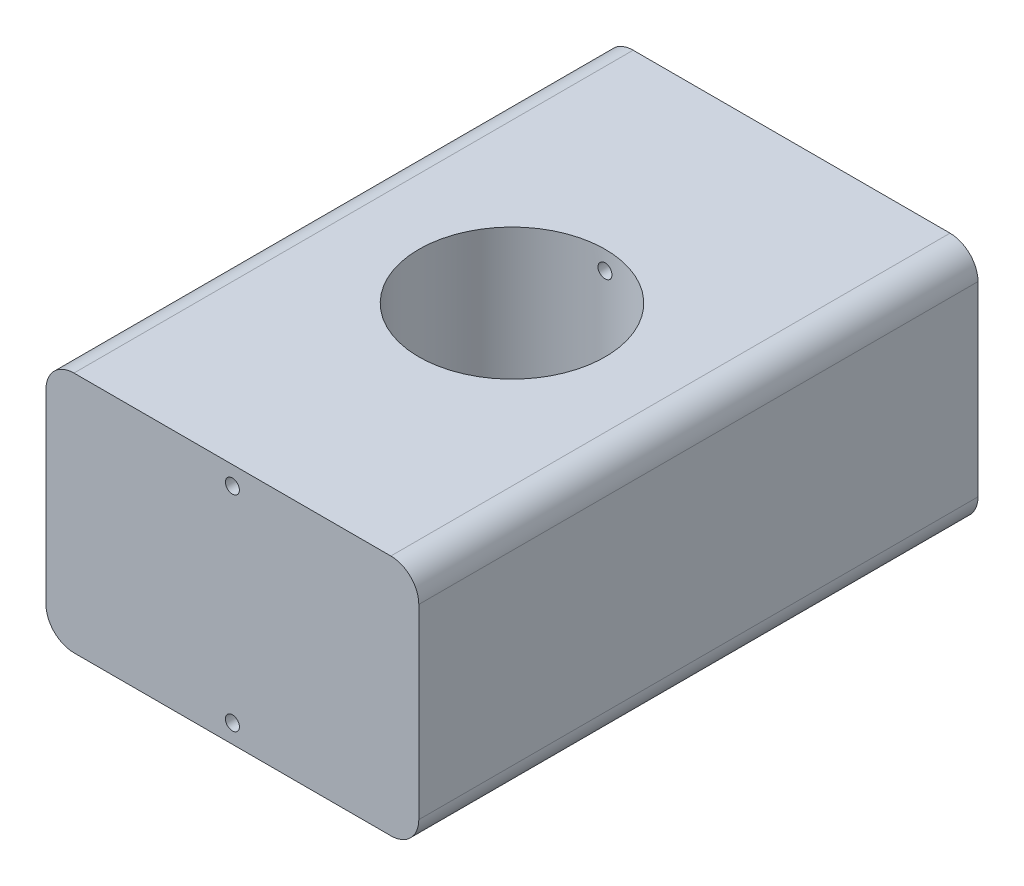
ISO-10303-21;
HEADER;
FILE_DESCRIPTION(('STEP AP214'),'2;1');
FILE_NAME('part.step','',(''),(''),'','','');
FILE_SCHEMA(('AUTOMOTIVE_DESIGN { 1 0 10303 214 1 1 1 1 }'));
ENDSEC;
DATA;
#1=APPLICATION_CONTEXT('core data for automotive mechanical design processes');
#2=APPLICATION_PROTOCOL_DEFINITION('international standard','automotive_design',2000,#1);
#3=PRODUCT_CONTEXT('',#1,'mechanical');
#4=PRODUCT('Part','Part','',(#3));
#5=PRODUCT_RELATED_PRODUCT_CATEGORY('part','',(#4));
#6=PRODUCT_DEFINITION_FORMATION('','',#4);
#7=PRODUCT_DEFINITION_CONTEXT('part definition',#1,'design');
#8=PRODUCT_DEFINITION('design','',#6,#7);
#9=PRODUCT_DEFINITION_SHAPE('','',#8);
#10=(LENGTH_UNIT() NAMED_UNIT(*) SI_UNIT(.MILLI.,.METRE.));
#11=(NAMED_UNIT(*) PLANE_ANGLE_UNIT() SI_UNIT($,.RADIAN.));
#12=(NAMED_UNIT(*) SI_UNIT($,.STERADIAN.) SOLID_ANGLE_UNIT());
#13=UNCERTAINTY_MEASURE_WITH_UNIT(LENGTH_MEASURE(1.E-05),#10,'distance_accuracy_value','');
#14=(GEOMETRIC_REPRESENTATION_CONTEXT(3) GLOBAL_UNCERTAINTY_ASSIGNED_CONTEXT((#13)) GLOBAL_UNIT_ASSIGNED_CONTEXT((#10,
#11,#12)) REPRESENTATION_CONTEXT('',''));
#15=CARTESIAN_POINT('',(0.,0.,0.));
#16=DIRECTION('',(0.,0.,1.));
#17=DIRECTION('',(1.,0.,0.));
#18=AXIS2_PLACEMENT_3D('',#15,#16,#17);
#19=CARTESIAN_POINT('',(0.,11.,60.));
#20=DIRECTION('',(0.,0.,-1.));
#21=DIRECTION('',(-1.,0.,0.));
#22=AXIS2_PLACEMENT_3D('',#19,#20,#21);
#23=CYLINDRICAL_SURFACE('',#22,0.75);
#24=CARTESIAN_POINT('',(-0.749999999999998,11.,39.9718353375896));
#25=CARTESIAN_POINT('',(-0.749998156422003,10.957935782861,39.9718357123555));
#26=CARTESIAN_POINT('',(-0.746449303697193,10.9158425741027,39.9721043609987));
#27=CARTESIAN_POINT('',(-0.732343920689902,10.8328197921761,39.9731499771179));
#28=CARTESIAN_POINT('',(-0.721779356159142,10.791891609276,39.9739275273627));
#29=CARTESIAN_POINT('',(-0.693948896624594,10.7124134082848,39.9759023845808));
#30=CARTESIAN_POINT('',(-0.676686687047649,10.6738620958004,39.9770994606721));
#31=CARTESIAN_POINT('',(-0.635957254899256,10.6002137472712,39.9797781979895));
#32=CARTESIAN_POINT('',(-0.612491399750993,10.5651159523299,39.9812597964808));
#33=CARTESIAN_POINT('',(-0.559967163907113,10.4992874881081,39.9843441490868));
#34=CARTESIAN_POINT('',(-0.530898444002643,10.4685650780521,39.9859471238096));
#35=CARTESIAN_POINT('',(-0.468015336253382,10.4124303376761,39.9890915810603));
#36=CARTESIAN_POINT('',(-0.434200745296518,10.3870182347407,39.9906330609528));
#37=CARTESIAN_POINT('',(-0.362737435634397,10.3421987239576,39.9934828697797));
#38=CARTESIAN_POINT('',(-0.325084292730746,10.3227983514527,39.9947909247909));
#39=CARTESIAN_POINT('',(-0.247043642578321,10.2905980189398,39.9970241410314));
#40=CARTESIAN_POINT('',(-0.20665617511391,10.2777979629206,39.9979493078302));
#41=CARTESIAN_POINT('',(-0.124374625183516,10.2591850803478,39.9993109699866));
#42=CARTESIAN_POINT('',(-0.0824835476768486,10.253359038511,39.9997483894841));
#43=CARTESIAN_POINT('',(0.00168404565213551,10.2488187288879,40.0000883958622));
#44=CARTESIAN_POINT('',(0.0439605555211988,10.2501043514424,39.9999909909896));
#45=CARTESIAN_POINT('',(0.127609374074958,10.259740030427,39.999273089571));
#46=CARTESIAN_POINT('',(0.16898333020549,10.2680758744211,39.9986536454053));
#47=CARTESIAN_POINT('',(0.249743145706264,10.2915532919492,39.9969625776222));
#48=CARTESIAN_POINT('',(0.289128989232313,10.3066949197123,39.9958909504018));
#49=CARTESIAN_POINT('',(0.364839961924462,10.3433700400917,39.9934143055523));
#50=CARTESIAN_POINT('',(0.401161980495741,10.3649099306955,39.9920089544971));
#51=CARTESIAN_POINT('',(0.469680297251525,10.4137654902961,39.989022893938));
#52=CARTESIAN_POINT('',(0.501876527899065,10.4410812538215,39.9874421815644));
#53=CARTESIAN_POINT('',(0.561312371114616,10.5007933398287,39.9842785600421));
#54=CARTESIAN_POINT('',(0.588539584418748,10.5332020059579,39.9826956550675));
#55=CARTESIAN_POINT('',(0.63716880332874,10.6021368186644,39.9797099852835));
#56=CARTESIAN_POINT('',(0.658570805349996,10.6386629677753,39.978307220585));
#57=CARTESIAN_POINT('',(0.694941427452077,10.7148042521874,39.9758403341458));
#58=CARTESIAN_POINT('',(0.709909456736404,10.7544196707649,39.9747762435059));
#59=CARTESIAN_POINT('',(0.732978335898979,10.8356110403047,39.9731077249897));
#60=CARTESIAN_POINT('',(0.74107930242601,10.8771869579519,39.9725032893053));
#61=CARTESIAN_POINT('',(0.75016851104732,10.9610107884537,39.9718237225753));
#62=CARTESIAN_POINT('',(0.75117402007308,11.0032568190458,39.9717473065932));
#63=CARTESIAN_POINT('',(0.746088951169794,11.0873168799252,39.9721290367353));
#64=CARTESIAN_POINT('',(0.739998426687189,11.129130913464,39.9725871788334));
#65=CARTESIAN_POINT('',(0.72090855084985,11.2110907866781,39.9739852286117));
#66=CARTESIAN_POINT('',(0.707917211639427,11.2512385028579,39.974924577545));
#67=CARTESIAN_POINT('',(0.675402614394026,11.3287841336869,39.9771787266467));
#68=CARTESIAN_POINT('',(0.655879271216807,11.3661820124853,39.978493531709));
#69=CARTESIAN_POINT('',(0.6108109815781,11.4372455262786,39.9813535568317));
#70=CARTESIAN_POINT('',(0.58525450119474,11.470903828551,39.9828992161251));
#71=CARTESIAN_POINT('',(0.528862105167429,11.5334587491217,39.9860452774809));
#72=CARTESIAN_POINT('',(0.498026115742089,11.5623553008633,39.987645680308));
#73=CARTESIAN_POINT('',(0.431875535832204,11.6146251260539,39.9907246965366));
#74=CARTESIAN_POINT('',(0.396552082904171,11.637987200347,39.992203059116));
#75=CARTESIAN_POINT('',(0.322473610995098,11.6784481575469,39.9948678131289));
#76=CARTESIAN_POINT('',(0.283718620665108,11.6955470927407,39.9960542069998));
#77=CARTESIAN_POINT('',(0.203917766996166,11.7229770541775,39.9980001781889));
#78=CARTESIAN_POINT('',(0.162874319471616,11.7333150761046,39.9987601965721));
#79=CARTESIAN_POINT('',(0.0796282964101682,11.7469526298501,39.9997695614224));
#80=CARTESIAN_POINT('',(0.0374257382428242,11.7502522670821,40.0000189155376));
#81=CARTESIAN_POINT('',(-0.0468299511148537,11.7497182563946,39.9999788737347));
#82=CARTESIAN_POINT('',(-0.0888831948581358,11.7459020927181,39.9996907983345));
#83=CARTESIAN_POINT('',(-0.171749850747465,11.7312811780842,39.9986108899493));
#84=CARTESIAN_POINT('',(-0.212563260967768,11.7204764162726,39.9978190561819));
#85=CARTESIAN_POINT('',(-0.291793445984459,11.6921892597283,39.9958205402514));
#86=CARTESIAN_POINT('',(-0.330210298990643,11.6747070830408,39.9946138716345));
#87=CARTESIAN_POINT('',(-0.403566318516531,11.6335634836233,39.9919208924614));
#88=CARTESIAN_POINT('',(-0.438505555212459,11.6099021856191,39.9904345875499));
#89=CARTESIAN_POINT('',(-0.50400381266195,11.5570065946208,39.9873449714179));
#90=CARTESIAN_POINT('',(-0.534552440692298,11.5277594484441,39.9857413957111));
#91=CARTESIAN_POINT('',(-0.590318319841531,11.4645438177358,39.9826001922469));
#92=CARTESIAN_POINT('',(-0.61553427231023,11.4305741864822,39.9810625806259));
#93=CARTESIAN_POINT('',(-0.659946324713096,11.358823845859,39.9782247125904));
#94=CARTESIAN_POINT('',(-0.679132759094351,11.3210371443983,39.9769248386588));
#95=CARTESIAN_POINT('',(-0.710864681564984,11.2427953855322,39.9747143702894));
#96=CARTESIAN_POINT('',(-0.723417866920404,11.2023434824488,39.9738033248897));
#97=CARTESIAN_POINT('',(-0.73830124766561,11.1347075074226,39.9727099136248));
#98=CARTESIAN_POINT('',(-0.742682517460155,11.1079594349993,39.9723834368796));
#99=CARTESIAN_POINT('',(-0.748532483961892,11.0541449126717,39.9719460284623));
#100=CARTESIAN_POINT('',(-0.750001186786838,11.0270784634363,39.9718350963374));
#101=CARTESIAN_POINT('',(-0.749999999999998,11.,39.9718353375896));
#102=B_SPLINE_CURVE_WITH_KNOTS('',3,(#24,#25,#26,#27,#28,#29,#30,#31,#32,#33,#34,#35,#36,#37,
#38,#39,#40,#41,#42,#43,#44,#45,#46,#47,#48,#49,#50,#51,#52,#53,#54,#55,#56,#57,#58,#59,#60,#61,
#62,#63,#64,#65,#66,#67,#68,#69,#70,#71,#72,#73,#74,#75,#76,#77,#78,#79,#80,#81,#82,#83,#84,#85,
#86,#87,#88,#89,#90,#91,#92,#93,#94,#95,#96,#97,#98,#99,#100,#101),.UNSPECIFIED.,.T.,.F.,(4,2,2,
2,2,2,2,2,2,2,2,2,2,2,2,2,2,2,2,2,2,2,2,2,2,2,2,2,2,2,2,2,2,2,2,2,2,2,4),(0.,0.12609378966952,
0.252332228930398,0.378501302881094,0.504642589480716,0.63101891804501,0.757400656867901,
0.883929742605129,1.01045698774234,1.1367440908708,1.26302924670639,1.3890604312979,
1.51509262013199,1.64125126243538,1.76741196962522,1.8938833070319,2.02035472226386,
2.1468377481941,2.27331862555119,2.39949160279741,2.52566362973065,2.65168948465478,
2.77771698234301,2.9039873941283,3.03025957069264,3.15678512042436,3.2833096138517,
3.40970298124725,3.53609445563983,3.66217578254461,3.78825730527236,3.91433471127213,
4.04040957258903,4.1667781089207,4.29317738404833,4.41977826059327,4.54623190422487,
4.62740382366758,4.70857557261108),.UNSPECIFIED.);
#103=CARTESIAN_POINT('',(-0.749999999999998,11.,39.9718353375896));
#104=VERTEX_POINT('',#103);
#105=EDGE_CURVE('E217',#104,#104,#102,.T.);
#106=ORIENTED_EDGE('',*,*,#105,.F.);
#107=EDGE_LOOP('',(#106));
#108=FACE_BOUND('',#107,.T.);
#109=CARTESIAN_POINT('',(0.,11.,60.));
#110=DIRECTION('',(0.,0.,1.));
#111=DIRECTION('',(1.,0.,0.));
#112=AXIS2_PLACEMENT_3D('',#109,#110,#111);
#113=CIRCLE('',#112,0.75);
#114=CARTESIAN_POINT('',(0.750000000000003,11.,60.));
#115=VERTEX_POINT('',#114);
#116=EDGE_CURVE('E147',#115,#115,#113,.T.);
#117=ORIENTED_EDGE('',*,*,#116,.T.);
#118=EDGE_LOOP('',(#117));
#119=FACE_BOUND('',#118,.T.);
#120=ADVANCED_FACE('F39',(#108,#119),#23,.F.);
#121=CARTESIAN_POINT('',(0.,-11.,60.));
#122=DIRECTION('',(0.,0.,-1.));
#123=DIRECTION('',(-1.,0.,0.));
#124=AXIS2_PLACEMENT_3D('',#121,#122,#123);
#125=CYLINDRICAL_SURFACE('',#124,0.75);
#126=CARTESIAN_POINT('',(-0.749999999999998,-11.,39.9718353375896));
#127=CARTESIAN_POINT('',(-0.749998156422003,-11.042064217139,39.9718357123555));
#128=CARTESIAN_POINT('',(-0.746449303697193,-11.0841574258973,39.9721043609987));
#129=CARTESIAN_POINT('',(-0.732343920689902,-11.1671802078239,39.9731499771179));
#130=CARTESIAN_POINT('',(-0.721779356159142,-11.208108390724,39.9739275273627));
#131=CARTESIAN_POINT('',(-0.693948896624594,-11.2875865917152,39.9759023845808));
#132=CARTESIAN_POINT('',(-0.676686687047649,-11.3261379041996,39.9770994606721));
#133=CARTESIAN_POINT('',(-0.635957254899256,-11.3997862527288,39.9797781979895));
#134=CARTESIAN_POINT('',(-0.612491399750993,-11.4348840476701,39.9812597964808));
#135=CARTESIAN_POINT('',(-0.559967163907113,-11.5007125118919,39.9843441490868));
#136=CARTESIAN_POINT('',(-0.530898444002643,-11.5314349219479,39.9859471238096));
#137=CARTESIAN_POINT('',(-0.468015336253382,-11.5875696623239,39.9890915810603));
#138=CARTESIAN_POINT('',(-0.434200745296518,-11.6129817652593,39.9906330609528));
#139=CARTESIAN_POINT('',(-0.362737435634397,-11.6578012760424,39.9934828697797));
#140=CARTESIAN_POINT('',(-0.325084292730746,-11.6772016485473,39.9947909247909));
#141=CARTESIAN_POINT('',(-0.247043642578321,-11.7094019810602,39.9970241410314));
#142=CARTESIAN_POINT('',(-0.20665617511391,-11.7222020370794,39.9979493078302));
#143=CARTESIAN_POINT('',(-0.124374625183516,-11.7408149196522,39.9993109699866));
#144=CARTESIAN_POINT('',(-0.0824835476768486,-11.746640961489,39.9997483894841));
#145=CARTESIAN_POINT('',(0.00168404565213551,-11.7511812711121,40.0000883958622));
#146=CARTESIAN_POINT('',(0.0439605555211988,-11.7498956485576,39.9999909909896));
#147=CARTESIAN_POINT('',(0.127609374074958,-11.740259969573,39.999273089571));
#148=CARTESIAN_POINT('',(0.16898333020549,-11.7319241255789,39.9986536454053));
#149=CARTESIAN_POINT('',(0.249743145706264,-11.7084467080508,39.9969625776222));
#150=CARTESIAN_POINT('',(0.289128989232313,-11.6933050802877,39.9958909504018));
#151=CARTESIAN_POINT('',(0.364839961924462,-11.6566299599083,39.9934143055523));
#152=CARTESIAN_POINT('',(0.401161980495741,-11.6350900693045,39.9920089544971));
#153=CARTESIAN_POINT('',(0.469680297251525,-11.5862345097039,39.989022893938));
#154=CARTESIAN_POINT('',(0.501876527899065,-11.5589187461785,39.9874421815644));
#155=CARTESIAN_POINT('',(0.561312371114616,-11.4992066601713,39.9842785600421));
#156=CARTESIAN_POINT('',(0.588539584418748,-11.4667979940421,39.9826956550675));
#157=CARTESIAN_POINT('',(0.63716880332874,-11.3978631813356,39.9797099852835));
#158=CARTESIAN_POINT('',(0.658570805349996,-11.3613370322247,39.978307220585));
#159=CARTESIAN_POINT('',(0.694941427452077,-11.2851957478126,39.9758403341458));
#160=CARTESIAN_POINT('',(0.709909456736403,-11.2455803292351,39.9747762435059));
#161=CARTESIAN_POINT('',(0.732978335898978,-11.1643889596953,39.9731077249897));
#162=CARTESIAN_POINT('',(0.741079302426009,-11.1228130420481,39.9725032893053));
#163=CARTESIAN_POINT('',(0.75016851104732,-11.0389892115463,39.9718237225753));
#164=CARTESIAN_POINT('',(0.75117402007308,-10.9967431809542,39.9717473065932));
#165=CARTESIAN_POINT('',(0.746088951169795,-10.9126831200748,39.9721290367353));
#166=CARTESIAN_POINT('',(0.739998426687189,-10.870869086536,39.9725871788334));
#167=CARTESIAN_POINT('',(0.72090855084985,-10.7889092133219,39.9739852286117));
#168=CARTESIAN_POINT('',(0.707917211639427,-10.7487614971421,39.974924577545));
#169=CARTESIAN_POINT('',(0.675402614394026,-10.6712158663131,39.9771787266467));
#170=CARTESIAN_POINT('',(0.655879271216807,-10.6338179875147,39.978493531709));
#171=CARTESIAN_POINT('',(0.6108109815781,-10.5627544737213,39.9813535568317));
#172=CARTESIAN_POINT('',(0.58525450119474,-10.529096171449,39.9828992161251));
#173=CARTESIAN_POINT('',(0.528862105167429,-10.4665412508783,39.9860452774809));
#174=CARTESIAN_POINT('',(0.498026115742089,-10.4376446991367,39.987645680308));
#175=CARTESIAN_POINT('',(0.431875535832204,-10.3853748739461,39.9907246965366));
#176=CARTESIAN_POINT('',(0.396552082904172,-10.362012799653,39.992203059116));
#177=CARTESIAN_POINT('',(0.322473610995099,-10.3215518424531,39.9948678131289));
#178=CARTESIAN_POINT('',(0.283718620665108,-10.3044529072593,39.9960542069998));
#179=CARTESIAN_POINT('',(0.203917766996165,-10.2770229458225,39.9980001781889));
#180=CARTESIAN_POINT('',(0.162874319471616,-10.2666849238954,39.9987601965721));
#181=CARTESIAN_POINT('',(0.0796282964101682,-10.2530473701499,39.9997695614224));
#182=CARTESIAN_POINT('',(0.0374257382428242,-10.2497477329179,40.0000189155376));
#183=CARTESIAN_POINT('',(-0.0468299511148537,-10.2502817436054,39.9999788737347));
#184=CARTESIAN_POINT('',(-0.0888831948581358,-10.2540979072819,39.9996907983345));
#185=CARTESIAN_POINT('',(-0.171749850747465,-10.2687188219157,39.9986108899493));
#186=CARTESIAN_POINT('',(-0.212563260967768,-10.2795235837274,39.9978190561819));
#187=CARTESIAN_POINT('',(-0.291793445984459,-10.3078107402717,39.9958205402514));
#188=CARTESIAN_POINT('',(-0.330210298990642,-10.3252929169592,39.9946138716345));
#189=CARTESIAN_POINT('',(-0.403566318516531,-10.3664365163767,39.9919208924614));
#190=CARTESIAN_POINT('',(-0.438505555212459,-10.3900978143809,39.9904345875499));
#191=CARTESIAN_POINT('',(-0.50400381266195,-10.4429934053792,39.9873449714179));
#192=CARTESIAN_POINT('',(-0.534552440692298,-10.4722405515559,39.9857413957111));
#193=CARTESIAN_POINT('',(-0.590318319841531,-10.5354561822642,39.9826001922469));
#194=CARTESIAN_POINT('',(-0.61553427231023,-10.5694258135178,39.9810625806259));
#195=CARTESIAN_POINT('',(-0.659946324713096,-10.641176154141,39.9782247125904));
#196=CARTESIAN_POINT('',(-0.679132759094351,-10.6789628556017,39.9769248386588));
#197=CARTESIAN_POINT('',(-0.710864681564984,-10.7572046144678,39.9747143702894));
#198=CARTESIAN_POINT('',(-0.723417866920404,-10.7976565175511,39.9738033248897));
#199=CARTESIAN_POINT('',(-0.73830124766561,-10.8652924925774,39.9727099136248));
#200=CARTESIAN_POINT('',(-0.742682517460155,-10.8920405650007,39.9723834368796));
#201=CARTESIAN_POINT('',(-0.748532483961892,-10.9458550873283,39.9719460284623));
#202=CARTESIAN_POINT('',(-0.750001186786838,-10.9729215365637,39.9718350963374));
#203=CARTESIAN_POINT('',(-0.749999999999998,-11.,39.9718353375896));
#204=B_SPLINE_CURVE_WITH_KNOTS('',3,(#126,#127,#128,#129,#130,#131,#132,#133,#134,#135,#136,
#137,#138,#139,#140,#141,#142,#143,#144,#145,#146,#147,#148,#149,#150,#151,#152,#153,#154,#155,
#156,#157,#158,#159,#160,#161,#162,#163,#164,#165,#166,#167,#168,#169,#170,#171,#172,#173,#174,
#175,#176,#177,#178,#179,#180,#181,#182,#183,#184,#185,#186,#187,#188,#189,#190,#191,#192,#193,
#194,#195,#196,#197,#198,#199,#200,#201,#202,#203),.UNSPECIFIED.,.T.,.F.,(4,2,2,2,2,2,2,2,2,2,2,
2,2,2,2,2,2,2,2,2,2,2,2,2,2,2,2,2,2,2,2,2,2,2,2,2,2,2,4),(0.,0.12609378966952,0.252332228930398,
0.378501302881094,0.504642589480716,0.63101891804501,0.757400656867901,0.883929742605129,
1.01045698774234,1.1367440908708,1.26302924670639,1.3890604312979,1.51509262013199,
1.64125126243538,1.76741196962522,1.8938833070319,2.02035472226386,2.1468377481941,
2.27331862555119,2.39949160279741,2.52566362973065,2.65168948465478,2.77771698234301,
2.9039873941283,3.03025957069264,3.15678512042436,3.2833096138517,3.40970298124725,
3.53609445563983,3.66217578254461,3.78825730527236,3.91433471127213,4.04040957258903,
4.1667781089207,4.29317738404833,4.41977826059327,4.54623190422486,4.62740382366758,
4.70857557261108),.UNSPECIFIED.);
#205=CARTESIAN_POINT('',(-0.749999999999998,-11.,39.9718353375896));
#206=VERTEX_POINT('',#205);
#207=EDGE_CURVE('E43',#206,#206,#204,.T.);
#208=ORIENTED_EDGE('',*,*,#207,.F.);
#209=EDGE_LOOP('',(#208));
#210=FACE_BOUND('',#209,.T.);
#211=CARTESIAN_POINT('',(0.,-11.,60.));
#212=DIRECTION('',(0.,0.,1.));
#213=DIRECTION('',(1.,0.,0.));
#214=AXIS2_PLACEMENT_3D('',#211,#212,#213);
#215=CIRCLE('',#214,0.75);
#216=CARTESIAN_POINT('',(0.750000000000003,-11.,60.));
#217=VERTEX_POINT('',#216);
#218=EDGE_CURVE('E282',#217,#217,#215,.T.);
#219=ORIENTED_EDGE('',*,*,#218,.T.);
#220=EDGE_LOOP('',(#219));
#221=FACE_BOUND('',#220,.T.);
#222=ADVANCED_FACE('F234',(#210,#221),#125,.F.);
#223=CARTESIAN_POINT('',(0.,0.,60.));
#224=DIRECTION('',(0.,0.,-1.));
#225=DIRECTION('',(-1.,0.,0.));
#226=AXIS2_PLACEMENT_3D('',#223,#224,#225);
#227=PLANE('',#226);
#228=DIRECTION('',(0.,-1.,0.));
#229=VECTOR('',#228,1.);
#230=CARTESIAN_POINT('',(-20.,-13.,60.));
#231=LINE('',#230,#229);
#232=CARTESIAN_POINT('',(-20.,10.,60.));
#233=VERTEX_POINT('',#232);
#234=CARTESIAN_POINT('',(-20.,-10.,60.));
#235=VERTEX_POINT('',#234);
#236=EDGE_CURVE('E291',#233,#235,#231,.T.);
#237=ORIENTED_EDGE('',*,*,#236,.T.);
#238=CARTESIAN_POINT('',(-17.,-10.,60.));
#239=DIRECTION('',(0.,0.,-1.));
#240=DIRECTION('',(-1.,0.,0.));
#241=AXIS2_PLACEMENT_3D('',#238,#239,#240);
#242=CIRCLE('',#241,3.);
#243=CARTESIAN_POINT('',(-17.,-13.,60.));
#244=VERTEX_POINT('',#243);
#245=EDGE_CURVE('E187',#235,#244,#242,.F.);
#246=ORIENTED_EDGE('',*,*,#245,.T.);
#247=DIRECTION('',(1.,0.,0.));
#248=VECTOR('',#247,1.);
#249=CARTESIAN_POINT('',(-20.,-13.,60.));
#250=LINE('',#249,#248);
#251=CARTESIAN_POINT('',(17.,-13.,60.));
#252=VERTEX_POINT('',#251);
#253=EDGE_CURVE('E131',#244,#252,#250,.T.);
#254=ORIENTED_EDGE('',*,*,#253,.T.);
#255=CARTESIAN_POINT('',(17.,-10.,60.));
#256=DIRECTION('',(0.,0.,-1.));
#257=DIRECTION('',(-1.,0.,0.));
#258=AXIS2_PLACEMENT_3D('',#255,#256,#257);
#259=CIRCLE('',#258,3.);
#260=CARTESIAN_POINT('',(20.,-10.,60.));
#261=VERTEX_POINT('',#260);
#262=EDGE_CURVE('E69',#252,#261,#259,.F.);
#263=ORIENTED_EDGE('',*,*,#262,.T.);
#264=DIRECTION('',(0.,1.,0.));
#265=VECTOR('',#264,1.);
#266=CARTESIAN_POINT('',(20.,-13.,60.));
#267=LINE('',#266,#265);
#268=CARTESIAN_POINT('',(20.,10.,60.));
#269=VERTEX_POINT('',#268);
#270=EDGE_CURVE('E153',#261,#269,#267,.T.);
#271=ORIENTED_EDGE('',*,*,#270,.T.);
#272=CARTESIAN_POINT('',(17.,10.,60.));
#273=DIRECTION('',(0.,0.,-1.));
#274=DIRECTION('',(-1.,0.,0.));
#275=AXIS2_PLACEMENT_3D('',#272,#273,#274);
#276=CIRCLE('',#275,3.);
#277=CARTESIAN_POINT('',(17.,13.,60.));
#278=VERTEX_POINT('',#277);
#279=EDGE_CURVE('E157',#269,#278,#276,.F.);
#280=ORIENTED_EDGE('',*,*,#279,.T.);
#281=DIRECTION('',(-1.,0.,0.));
#282=VECTOR('',#281,1.);
#283=CARTESIAN_POINT('',(-20.,13.,60.));
#284=LINE('',#283,#282);
#285=CARTESIAN_POINT('',(-17.,13.,60.));
#286=VERTEX_POINT('',#285);
#287=EDGE_CURVE('E129',#278,#286,#284,.T.);
#288=ORIENTED_EDGE('',*,*,#287,.T.);
#289=CARTESIAN_POINT('',(-17.,10.,60.));
#290=DIRECTION('',(0.,0.,-1.));
#291=DIRECTION('',(-1.,0.,0.));
#292=AXIS2_PLACEMENT_3D('',#289,#290,#291);
#293=CIRCLE('',#292,3.);
#294=EDGE_CURVE('E184',#286,#233,#293,.F.);
#295=ORIENTED_EDGE('',*,*,#294,.T.);
#296=EDGE_LOOP('',(#237,#246,#254,#263,#271,#280,#288,#295));
#297=FACE_BOUND('',#296,.T.);
#298=ORIENTED_EDGE('',*,*,#116,.F.);
#299=EDGE_LOOP('',(#298));
#300=FACE_BOUND('',#299,.T.);
#301=ORIENTED_EDGE('',*,*,#218,.F.);
#302=EDGE_LOOP('',(#301));
#303=FACE_BOUND('',#302,.T.);
#304=ADVANCED_FACE('F230',(#297,#300,#303),#227,.F.);
#305=CARTESIAN_POINT('',(0.,0.,0.));
#306=DIRECTION('',(0.,0.,-1.));
#307=DIRECTION('',(-1.,0.,0.));
#308=AXIS2_PLACEMENT_3D('',#305,#306,#307);
#309=PLANE('',#308);
#310=CARTESIAN_POINT('',(0.,11.,0.));
#311=DIRECTION('',(0.,0.,1.));
#312=DIRECTION('',(1.,0.,0.));
#313=AXIS2_PLACEMENT_3D('',#310,#311,#312);
#314=CIRCLE('',#313,0.75);
#315=CARTESIAN_POINT('',(0.750000000000003,11.,0.));
#316=VERTEX_POINT('',#315);
#317=EDGE_CURVE('E278',#316,#316,#314,.T.);
#318=ORIENTED_EDGE('',*,*,#317,.T.);
#319=EDGE_LOOP('',(#318));
#320=FACE_BOUND('',#319,.T.);
#321=DIRECTION('',(1.,0.,0.));
#322=VECTOR('',#321,1.);
#323=CARTESIAN_POINT('',(-20.,-13.,0.));
#324=LINE('',#323,#322);
#325=CARTESIAN_POINT('',(-17.,-13.,0.));
#326=VERTEX_POINT('',#325);
#327=CARTESIAN_POINT('',(17.,-13.,0.));
#328=VERTEX_POINT('',#327);
#329=EDGE_CURVE('E145',#326,#328,#324,.T.);
#330=ORIENTED_EDGE('',*,*,#329,.F.);
#331=CARTESIAN_POINT('',(-17.,-10.,0.));
#332=DIRECTION('',(0.,0.,-1.));
#333=DIRECTION('',(-1.,0.,0.));
#334=AXIS2_PLACEMENT_3D('',#331,#332,#333);
#335=CIRCLE('',#334,3.);
#336=CARTESIAN_POINT('',(-20.,-10.,0.));
#337=VERTEX_POINT('',#336);
#338=EDGE_CURVE('E172',#326,#337,#335,.T.);
#339=ORIENTED_EDGE('',*,*,#338,.T.);
#340=DIRECTION('',(0.,-1.,0.));
#341=VECTOR('',#340,1.);
#342=CARTESIAN_POINT('',(-20.,-13.,0.));
#343=LINE('',#342,#341);
#344=CARTESIAN_POINT('',(-20.,10.,0.));
#345=VERTEX_POINT('',#344);
#346=EDGE_CURVE('E139',#345,#337,#343,.T.);
#347=ORIENTED_EDGE('',*,*,#346,.F.);
#348=CARTESIAN_POINT('',(-17.,10.,0.));
#349=DIRECTION('',(0.,0.,-1.));
#350=DIRECTION('',(-1.,0.,0.));
#351=AXIS2_PLACEMENT_3D('',#348,#349,#350);
#352=CIRCLE('',#351,3.);
#353=CARTESIAN_POINT('',(-17.,13.,0.));
#354=VERTEX_POINT('',#353);
#355=EDGE_CURVE('E137',#345,#354,#352,.T.);
#356=ORIENTED_EDGE('',*,*,#355,.T.);
#357=DIRECTION('',(-1.,0.,0.));
#358=VECTOR('',#357,1.);
#359=CARTESIAN_POINT('',(-20.,13.,0.));
#360=LINE('',#359,#358);
#361=CARTESIAN_POINT('',(17.,13.,0.));
#362=VERTEX_POINT('',#361);
#363=EDGE_CURVE('E128',#362,#354,#360,.T.);
#364=ORIENTED_EDGE('',*,*,#363,.F.);
#365=CARTESIAN_POINT('',(17.,10.,0.));
#366=DIRECTION('',(0.,0.,-1.));
#367=DIRECTION('',(-1.,0.,0.));
#368=AXIS2_PLACEMENT_3D('',#365,#366,#367);
#369=CIRCLE('',#368,3.);
#370=CARTESIAN_POINT('',(20.,10.,0.));
#371=VERTEX_POINT('',#370);
#372=EDGE_CURVE('E115',#362,#371,#369,.T.);
#373=ORIENTED_EDGE('',*,*,#372,.T.);
#374=DIRECTION('',(0.,1.,0.));
#375=VECTOR('',#374,1.);
#376=CARTESIAN_POINT('',(20.,-13.,0.));
#377=LINE('',#376,#375);
#378=CARTESIAN_POINT('',(20.,-10.,0.));
#379=VERTEX_POINT('',#378);
#380=EDGE_CURVE('E140',#379,#371,#377,.T.);
#381=ORIENTED_EDGE('',*,*,#380,.F.);
#382=CARTESIAN_POINT('',(17.,-10.,0.));
#383=DIRECTION('',(0.,0.,-1.));
#384=DIRECTION('',(-1.,0.,0.));
#385=AXIS2_PLACEMENT_3D('',#382,#383,#384);
#386=CIRCLE('',#385,3.);
#387=EDGE_CURVE('E167',#379,#328,#386,.T.);
#388=ORIENTED_EDGE('',*,*,#387,.T.);
#389=EDGE_LOOP('',(#330,#339,#347,#356,#364,#373,#381,#388));
#390=FACE_BOUND('',#389,.T.);
#391=CARTESIAN_POINT('',(0.,-11.,0.));
#392=DIRECTION('',(0.,0.,1.));
#393=DIRECTION('',(1.,0.,0.));
#394=AXIS2_PLACEMENT_3D('',#391,#392,#393);
#395=CIRCLE('',#394,0.75);
#396=CARTESIAN_POINT('',(0.750000000000003,-11.,0.));
#397=VERTEX_POINT('',#396);
#398=EDGE_CURVE('E285',#397,#397,#395,.T.);
#399=ORIENTED_EDGE('',*,*,#398,.T.);
#400=EDGE_LOOP('',(#399));
#401=FACE_BOUND('',#400,.T.);
#402=ADVANCED_FACE('F134',(#320,#390,#401),#309,.T.);
#403=CARTESIAN_POINT('',(20.,-13.,60.));
#404=DIRECTION('',(-1.,0.,0.));
#405=DIRECTION('',(0.,0.,1.));
#406=AXIS2_PLACEMENT_3D('',#403,#404,#405);
#407=PLANE('',#406);
#408=ORIENTED_EDGE('',*,*,#270,.F.);
#409=DIRECTION('',(0.,0.,-1.));
#410=VECTOR('',#409,1.);
#411=CARTESIAN_POINT('',(20.,-10.,60.));
#412=LINE('',#411,#410);
#413=EDGE_CURVE('E11',#261,#379,#412,.T.);
#414=ORIENTED_EDGE('',*,*,#413,.T.);
#415=ORIENTED_EDGE('',*,*,#380,.T.);
#416=DIRECTION('',(0.,0.,-1.));
#417=VECTOR('',#416,1.);
#418=CARTESIAN_POINT('',(20.,10.,60.));
#419=LINE('',#418,#417);
#420=EDGE_CURVE('E121',#371,#269,#419,.F.);
#421=ORIENTED_EDGE('',*,*,#420,.T.);
#422=EDGE_LOOP('',(#408,#414,#415,#421));
#423=FACE_BOUND('',#422,.T.);
#424=ADVANCED_FACE('F237',(#423),#407,.F.);
#425=CARTESIAN_POINT('',(-20.,13.,60.));
#426=DIRECTION('',(0.,-1.,0.));
#427=DIRECTION('',(1.,0.,0.));
#428=AXIS2_PLACEMENT_3D('',#425,#426,#427);
#429=PLANE('',#428);
#430=CARTESIAN_POINT('',(0.,13.,30.));
#431=DIRECTION('',(0.,1.,0.));
#432=DIRECTION('',(-1.,0.,0.));
#433=AXIS2_PLACEMENT_3D('',#430,#431,#432);
#434=CIRCLE('',#433,10.);
#435=CARTESIAN_POINT('',(-10.,13.,30.));
#436=VERTEX_POINT('',#435);
#437=EDGE_CURVE('E218',#436,#436,#434,.T.);
#438=ORIENTED_EDGE('',*,*,#437,.F.);
#439=EDGE_LOOP('',(#438));
#440=FACE_BOUND('',#439,.T.);
#441=ORIENTED_EDGE('',*,*,#363,.T.);
#442=DIRECTION('',(0.,0.,-1.));
#443=VECTOR('',#442,1.);
#444=CARTESIAN_POINT('',(-17.,13.,60.));
#445=LINE('',#444,#443);
#446=EDGE_CURVE('E54',#354,#286,#445,.F.);
#447=ORIENTED_EDGE('',*,*,#446,.T.);
#448=ORIENTED_EDGE('',*,*,#287,.F.);
#449=DIRECTION('',(0.,0.,-1.));
#450=VECTOR('',#449,1.);
#451=CARTESIAN_POINT('',(17.,13.,60.));
#452=LINE('',#451,#450);
#453=EDGE_CURVE('E119',#278,#362,#452,.T.);
#454=ORIENTED_EDGE('',*,*,#453,.T.);
#455=EDGE_LOOP('',(#441,#447,#448,#454));
#456=FACE_BOUND('',#455,.T.);
#457=ADVANCED_FACE('F127',(#440,#456),#429,.F.);
#458=CARTESIAN_POINT('',(-20.,-13.,60.));
#459=DIRECTION('',(1.,0.,0.));
#460=DIRECTION('',(0.,1.,0.));
#461=AXIS2_PLACEMENT_3D('',#458,#459,#460);
#462=PLANE('',#461);
#463=ORIENTED_EDGE('',*,*,#346,.T.);
#464=DIRECTION('',(0.,0.,-1.));
#465=VECTOR('',#464,1.);
#466=CARTESIAN_POINT('',(-20.,-10.,60.));
#467=LINE('',#466,#465);
#468=EDGE_CURVE('E179',#337,#235,#467,.F.);
#469=ORIENTED_EDGE('',*,*,#468,.T.);
#470=ORIENTED_EDGE('',*,*,#236,.F.);
#471=DIRECTION('',(0.,0.,-1.));
#472=VECTOR('',#471,1.);
#473=CARTESIAN_POINT('',(-20.,10.,60.));
#474=LINE('',#473,#472);
#475=EDGE_CURVE('E175',#233,#345,#474,.T.);
#476=ORIENTED_EDGE('',*,*,#475,.T.);
#477=EDGE_LOOP('',(#463,#469,#470,#476));
#478=FACE_BOUND('',#477,.T.);
#479=ADVANCED_FACE('F241',(#478),#462,.F.);
#480=CARTESIAN_POINT('',(-20.,-13.,60.));
#481=DIRECTION('',(0.,1.,0.));
#482=DIRECTION('',(0.,0.,1.));
#483=AXIS2_PLACEMENT_3D('',#480,#481,#482);
#484=PLANE('',#483);
#485=CARTESIAN_POINT('',(0.,-13.,30.));
#486=DIRECTION('',(0.,1.,0.));
#487=DIRECTION('',(-1.,0.,0.));
#488=AXIS2_PLACEMENT_3D('',#485,#486,#487);
#489=CIRCLE('',#488,10.);
#490=CARTESIAN_POINT('',(-10.,-13.,30.));
#491=VERTEX_POINT('',#490);
#492=EDGE_CURVE('E197',#491,#491,#489,.T.);
#493=ORIENTED_EDGE('',*,*,#492,.T.);
#494=EDGE_LOOP('',(#493));
#495=FACE_BOUND('',#494,.T.);
#496=ORIENTED_EDGE('',*,*,#253,.F.);
#497=DIRECTION('',(0.,0.,-1.));
#498=VECTOR('',#497,1.);
#499=CARTESIAN_POINT('',(-17.,-13.,60.));
#500=LINE('',#499,#498);
#501=EDGE_CURVE('E163',#244,#326,#500,.T.);
#502=ORIENTED_EDGE('',*,*,#501,.T.);
#503=ORIENTED_EDGE('',*,*,#329,.T.);
#504=DIRECTION('',(0.,0.,-1.));
#505=VECTOR('',#504,1.);
#506=CARTESIAN_POINT('',(17.,-13.,60.));
#507=LINE('',#506,#505);
#508=EDGE_CURVE('E160',#328,#252,#507,.F.);
#509=ORIENTED_EDGE('',*,*,#508,.T.);
#510=EDGE_LOOP('',(#496,#502,#503,#509));
#511=FACE_BOUND('',#510,.T.);
#512=ADVANCED_FACE('F228',(#495,#511),#484,.F.);
#513=CARTESIAN_POINT('',(-0.749999999999998,11.,20.0281646624104));
#514=CARTESIAN_POINT('',(-0.749998156422003,11.0420642171389,20.0281642876445));
#515=CARTESIAN_POINT('',(-0.746449303697193,11.0841574258973,20.0278956390013));
#516=CARTESIAN_POINT('',(-0.732343920689902,11.1671802078239,20.0268500228821));
#517=CARTESIAN_POINT('',(-0.721779356159142,11.208108390724,20.0260724726373));
#518=CARTESIAN_POINT('',(-0.693948896624594,11.2875865917152,20.0240976154192));
#519=CARTESIAN_POINT('',(-0.676686687047649,11.3261379041996,20.0229005393279));
#520=CARTESIAN_POINT('',(-0.635957254899256,11.3997862527288,20.0202218020105));
#521=CARTESIAN_POINT('',(-0.612491399750993,11.4348840476701,20.0187402035192));
#522=CARTESIAN_POINT('',(-0.559967163907113,11.5007125118919,20.0156558509132));
#523=CARTESIAN_POINT('',(-0.530898444002643,11.5314349219479,20.0140528761904));
#524=CARTESIAN_POINT('',(-0.468015336253382,11.5875696623239,20.0109084189397));
#525=CARTESIAN_POINT('',(-0.434200745296518,11.6129817652593,20.0093669390472));
#526=CARTESIAN_POINT('',(-0.362737435634398,11.6578012760423,20.0065171302203));
#527=CARTESIAN_POINT('',(-0.325084292730747,11.6772016485473,20.0052090752091));
#528=CARTESIAN_POINT('',(-0.247043642578323,11.7094019810602,20.0029758589686));
#529=CARTESIAN_POINT('',(-0.206656175113912,11.7222020370794,20.0020506921698));
#530=CARTESIAN_POINT('',(-0.124374625183518,11.7408149196522,20.0006890300134));
#531=CARTESIAN_POINT('',(-0.0824835476768505,11.746640961489,20.0002516105159));
#532=CARTESIAN_POINT('',(0.0016840456521344,11.7511812711121,19.9999116041378));
#533=CARTESIAN_POINT('',(0.0439605555211982,11.7498956485576,20.0000090090104));
#534=CARTESIAN_POINT('',(0.127609374074958,11.740259969573,20.000726910429));
#535=CARTESIAN_POINT('',(0.16898333020549,11.7319241255789,20.0013463545947));
#536=CARTESIAN_POINT('',(0.249743145706264,11.7084467080508,20.0030374223778));
#537=CARTESIAN_POINT('',(0.289128989232313,11.6933050802877,20.0041090495982));
#538=CARTESIAN_POINT('',(0.364839961924463,11.6566299599083,20.0065856944477));
#539=CARTESIAN_POINT('',(0.401161980495742,11.6350900693045,20.0079910455029));
#540=CARTESIAN_POINT('',(0.469680297251526,11.5862345097039,20.010977106062));
#541=CARTESIAN_POINT('',(0.501876527899066,11.5589187461785,20.0125578184356));
#542=CARTESIAN_POINT('',(0.561312371114617,11.4992066601713,20.0157214399579));
#543=CARTESIAN_POINT('',(0.58853958441875,11.466797994042,20.0173043449325));
#544=CARTESIAN_POINT('',(0.637168803328742,11.3978631813356,20.0202900147165));
#545=CARTESIAN_POINT('',(0.658570805349997,11.3613370322247,20.021692779415));
#546=CARTESIAN_POINT('',(0.694941427452077,11.2851957478126,20.0241596658542));
#547=CARTESIAN_POINT('',(0.709909456736404,11.2455803292351,20.0252237564941));
#548=CARTESIAN_POINT('',(0.732978335898979,11.1643889596953,20.0268922750103));
#549=CARTESIAN_POINT('',(0.74107930242601,11.1228130420481,20.0274967106947));
#550=CARTESIAN_POINT('',(0.75016851104732,11.0389892115463,20.0281762774247));
#551=CARTESIAN_POINT('',(0.75117402007308,10.9967431809542,20.0282526934068));
#552=CARTESIAN_POINT('',(0.746088951169794,10.9126831200747,20.0278709632647));
#553=CARTESIAN_POINT('',(0.739998426687189,10.870869086536,20.0274128211666));
#554=CARTESIAN_POINT('',(0.72090855084985,10.7889092133219,20.0260147713883));
#555=CARTESIAN_POINT('',(0.707917211639427,10.7487614971421,20.025075422455));
#556=CARTESIAN_POINT('',(0.675402614394025,10.6712158663131,20.0228212733533));
#557=CARTESIAN_POINT('',(0.655879271216807,10.6338179875147,20.021506468291));
#558=CARTESIAN_POINT('',(0.6108109815781,10.5627544737213,20.0186464431683));
#559=CARTESIAN_POINT('',(0.58525450119474,10.529096171449,20.0171007838749));
#560=CARTESIAN_POINT('',(0.528862105167429,10.4665412508783,20.0139547225191));
#561=CARTESIAN_POINT('',(0.498026115742089,10.4376446991367,20.012354319692));
#562=CARTESIAN_POINT('',(0.431875535832204,10.3853748739461,20.0092753034634));
#563=CARTESIAN_POINT('',(0.396552082904172,10.362012799653,20.007796940884));
#564=CARTESIAN_POINT('',(0.322473610995099,10.3215518424531,20.0051321868711));
#565=CARTESIAN_POINT('',(0.283718620665108,10.3044529072593,20.0039457930002));
#566=CARTESIAN_POINT('',(0.203917766996166,10.2770229458225,20.0019998218111));
#567=CARTESIAN_POINT('',(0.162874319471616,10.2666849238954,20.0012398034279));
#568=CARTESIAN_POINT('',(0.0796282964101684,10.2530473701499,20.0002304385776));
#569=CARTESIAN_POINT('',(0.0374257382428244,10.2497477329179,19.9999810844624));
#570=CARTESIAN_POINT('',(-0.0468299511148536,10.2502817436054,20.0000211262653));
#571=CARTESIAN_POINT('',(-0.0888831948581357,10.2540979072819,20.0003092016655));
#572=CARTESIAN_POINT('',(-0.171749850747465,10.2687188219157,20.0013891100507));
#573=CARTESIAN_POINT('',(-0.212563260967768,10.2795235837274,20.0021809438181));
#574=CARTESIAN_POINT('',(-0.291793445984459,10.3078107402717,20.0041794597486));
#575=CARTESIAN_POINT('',(-0.330210298990643,10.3252929169592,20.0053861283655));
#576=CARTESIAN_POINT('',(-0.403566318516532,10.3664365163767,20.0080791075386));
#577=CARTESIAN_POINT('',(-0.43850555521246,10.3900978143809,20.0095654124501));
#578=CARTESIAN_POINT('',(-0.504003812661951,10.4429934053792,20.0126550285821));
#579=CARTESIAN_POINT('',(-0.5345524406923,10.4722405515559,20.0142586042889));
#580=CARTESIAN_POINT('',(-0.590318319841533,10.5354561822642,20.0173998077531));
#581=CARTESIAN_POINT('',(-0.615534272310232,10.5694258135178,20.0189374193741));
#582=CARTESIAN_POINT('',(-0.659946324713097,10.641176154141,20.0217752874096));
#583=CARTESIAN_POINT('',(-0.679132759094352,10.6789628556017,20.0230751613412));
#584=CARTESIAN_POINT('',(-0.710864681564984,10.7572046144678,20.0252856297106));
#585=CARTESIAN_POINT('',(-0.723417866920404,10.7976565175511,20.0261966751103));
#586=CARTESIAN_POINT('',(-0.73830124766561,10.8652924925774,20.0272900863752));
#587=CARTESIAN_POINT('',(-0.742682517460155,10.8920405650007,20.0276165631204));
#588=CARTESIAN_POINT('',(-0.748532483961892,10.9458550873283,20.0280539715377));
#589=CARTESIAN_POINT('',(-0.750001186786838,10.9729215365637,20.0281649036626));
#590=CARTESIAN_POINT('',(-0.749999999999998,11.,20.0281646624104));
#591=B_SPLINE_CURVE_WITH_KNOTS('',3,(#513,#514,#515,#516,#517,#518,#519,#520,#521,#522,#523,
#524,#525,#526,#527,#528,#529,#530,#531,#532,#533,#534,#535,#536,#537,#538,#539,#540,#541,#542,
#543,#544,#545,#546,#547,#548,#549,#550,#551,#552,#553,#554,#555,#556,#557,#558,#559,#560,#561,
#562,#563,#564,#565,#566,#567,#568,#569,#570,#571,#572,#573,#574,#575,#576,#577,#578,#579,#580,
#581,#582,#583,#584,#585,#586,#587,#588,#589,#590),.UNSPECIFIED.,.T.,.F.,(4,2,2,2,2,2,2,2,2,2,2,
2,2,2,2,2,2,2,2,2,2,2,2,2,2,2,2,2,2,2,2,2,2,2,2,2,2,2,4),(0.,0.12609378966952,0.252332228930398,
0.378501302881094,0.504642589480716,0.63101891804501,0.757400656867901,0.883929742605127,
1.01045698774234,1.1367440908708,1.26302924670638,1.3890604312979,1.51509262013199,
1.64125126243538,1.76741196962522,1.8938833070319,2.02035472226386,2.1468377481941,
2.27331862555119,2.39949160279741,2.52566362973065,2.65168948465478,2.77771698234301,
2.9039873941283,3.03025957069264,3.15678512042436,3.2833096138517,3.40970298124725,
3.53609445563983,3.66217578254461,3.78825730527236,3.91433471127213,4.04040957258903,
4.1667781089207,4.29317738404833,4.41977826059327,4.54623190422486,4.62740382366758,
4.70857557261107),.UNSPECIFIED.);
#592=CARTESIAN_POINT('',(-0.749999999999998,11.,20.0281646624104));
#593=VERTEX_POINT('',#592);
#594=EDGE_CURVE('E210',#593,#593,#591,.T.);
#595=ORIENTED_EDGE('',*,*,#594,.F.);
#596=EDGE_LOOP('',(#595));
#597=FACE_BOUND('',#596,.T.);
#598=ORIENTED_EDGE('',*,*,#317,.F.);
#599=EDGE_LOOP('',(#598));
#600=FACE_BOUND('',#599,.T.);
#601=ADVANCED_FACE('F224',(#597,#600),#23,.F.);
#602=CARTESIAN_POINT('',(-0.749999999999998,-11.,20.0281646624104));
#603=CARTESIAN_POINT('',(-0.749998156422003,-10.9579357828611,20.0281642876445));
#604=CARTESIAN_POINT('',(-0.746449303697193,-10.9158425741027,20.0278956390013));
#605=CARTESIAN_POINT('',(-0.732343920689902,-10.8328197921761,20.0268500228821));
#606=CARTESIAN_POINT('',(-0.721779356159142,-10.791891609276,20.0260724726373));
#607=CARTESIAN_POINT('',(-0.693948896624594,-10.7124134082848,20.0240976154192));
#608=CARTESIAN_POINT('',(-0.676686687047649,-10.6738620958004,20.0229005393279));
#609=CARTESIAN_POINT('',(-0.635957254899256,-10.6002137472712,20.0202218020105));
#610=CARTESIAN_POINT('',(-0.612491399750993,-10.5651159523299,20.0187402035192));
#611=CARTESIAN_POINT('',(-0.559967163907113,-10.4992874881081,20.0156558509132));
#612=CARTESIAN_POINT('',(-0.530898444002643,-10.4685650780521,20.0140528761904));
#613=CARTESIAN_POINT('',(-0.468015336253382,-10.4124303376761,20.0109084189397));
#614=CARTESIAN_POINT('',(-0.434200745296518,-10.3870182347407,20.0093669390472));
#615=CARTESIAN_POINT('',(-0.362737435634397,-10.3421987239576,20.0065171302203));
#616=CARTESIAN_POINT('',(-0.325084292730747,-10.3227983514527,20.0052090752091));
#617=CARTESIAN_POINT('',(-0.247043642578322,-10.2905980189398,20.0029758589686));
#618=CARTESIAN_POINT('',(-0.206656175113912,-10.2777979629206,20.0020506921698));
#619=CARTESIAN_POINT('',(-0.124374625183518,-10.2591850803478,20.0006890300134));
#620=CARTESIAN_POINT('',(-0.0824835476768504,-10.253359038511,20.0002516105159));
#621=CARTESIAN_POINT('',(0.00168404565213439,-10.2488187288879,19.9999116041378));
#622=CARTESIAN_POINT('',(0.0439605555211982,-10.2501043514424,20.0000090090104));
#623=CARTESIAN_POINT('',(0.127609374074958,-10.259740030427,20.000726910429));
#624=CARTESIAN_POINT('',(0.16898333020549,-10.2680758744211,20.0013463545947));
#625=CARTESIAN_POINT('',(0.249743145706264,-10.2915532919492,20.0030374223778));
#626=CARTESIAN_POINT('',(0.289128989232313,-10.3066949197123,20.0041090495982));
#627=CARTESIAN_POINT('',(0.364839961924463,-10.3433700400917,20.0065856944477));
#628=CARTESIAN_POINT('',(0.401161980495742,-10.3649099306955,20.0079910455029));
#629=CARTESIAN_POINT('',(0.469680297251526,-10.4137654902961,20.010977106062));
#630=CARTESIAN_POINT('',(0.501876527899066,-10.4410812538215,20.0125578184356));
#631=CARTESIAN_POINT('',(0.561312371114617,-10.5007933398287,20.0157214399579));
#632=CARTESIAN_POINT('',(0.58853958441875,-10.5332020059579,20.0173043449325));
#633=CARTESIAN_POINT('',(0.637168803328742,-10.6021368186644,20.0202900147165));
#634=CARTESIAN_POINT('',(0.658570805349997,-10.6386629677753,20.021692779415));
#635=CARTESIAN_POINT('',(0.694941427452077,-10.7148042521874,20.0241596658542));
#636=CARTESIAN_POINT('',(0.709909456736404,-10.7544196707649,20.0252237564941));
#637=CARTESIAN_POINT('',(0.732978335898979,-10.8356110403047,20.0268922750103));
#638=CARTESIAN_POINT('',(0.74107930242601,-10.8771869579519,20.0274967106947));
#639=CARTESIAN_POINT('',(0.75016851104732,-10.9610107884537,20.0281762774247));
#640=CARTESIAN_POINT('',(0.75117402007308,-11.0032568190458,20.0282526934068));
#641=CARTESIAN_POINT('',(0.746088951169795,-11.0873168799253,20.0278709632647));
#642=CARTESIAN_POINT('',(0.739998426687189,-11.129130913464,20.0274128211666));
#643=CARTESIAN_POINT('',(0.72090855084985,-11.2110907866781,20.0260147713883));
#644=CARTESIAN_POINT('',(0.707917211639427,-11.2512385028579,20.025075422455));
#645=CARTESIAN_POINT('',(0.675402614394025,-11.3287841336869,20.0228212733533));
#646=CARTESIAN_POINT('',(0.655879271216807,-11.3661820124853,20.021506468291));
#647=CARTESIAN_POINT('',(0.6108109815781,-11.4372455262787,20.0186464431683));
#648=CARTESIAN_POINT('',(0.58525450119474,-11.470903828551,20.0171007838749));
#649=CARTESIAN_POINT('',(0.528862105167429,-11.5334587491217,20.0139547225191));
#650=CARTESIAN_POINT('',(0.498026115742089,-11.5623553008633,20.012354319692));
#651=CARTESIAN_POINT('',(0.431875535832204,-11.6146251260539,20.0092753034634));
#652=CARTESIAN_POINT('',(0.396552082904171,-11.637987200347,20.007796940884));
#653=CARTESIAN_POINT('',(0.322473610995098,-11.6784481575469,20.0051321868711));
#654=CARTESIAN_POINT('',(0.283718620665108,-11.6955470927407,20.0039457930002));
#655=CARTESIAN_POINT('',(0.203917766996166,-11.7229770541775,20.0019998218111));
#656=CARTESIAN_POINT('',(0.162874319471616,-11.7333150761046,20.0012398034279));
#657=CARTESIAN_POINT('',(0.0796282964101685,-11.7469526298501,20.0002304385776));
#658=CARTESIAN_POINT('',(0.0374257382428244,-11.7502522670821,19.9999810844624));
#659=CARTESIAN_POINT('',(-0.0468299511148536,-11.7497182563946,20.0000211262653));
#660=CARTESIAN_POINT('',(-0.0888831948581359,-11.7459020927181,20.0003092016655));
#661=CARTESIAN_POINT('',(-0.171749850747465,-11.7312811780843,20.0013891100507));
#662=CARTESIAN_POINT('',(-0.212563260967768,-11.7204764162726,20.0021809438181));
#663=CARTESIAN_POINT('',(-0.291793445984459,-11.6921892597283,20.0041794597486));
#664=CARTESIAN_POINT('',(-0.330210298990643,-11.6747070830408,20.0053861283655));
#665=CARTESIAN_POINT('',(-0.403566318516532,-11.6335634836233,20.0080791075386));
#666=CARTESIAN_POINT('',(-0.43850555521246,-11.6099021856191,20.0095654124501));
#667=CARTESIAN_POINT('',(-0.50400381266195,-11.5570065946208,20.0126550285821));
#668=CARTESIAN_POINT('',(-0.534552440692299,-11.5277594484441,20.0142586042889));
#669=CARTESIAN_POINT('',(-0.590318319841532,-11.4645438177358,20.0173998077531));
#670=CARTESIAN_POINT('',(-0.615534272310231,-11.4305741864822,20.0189374193741));
#671=CARTESIAN_POINT('',(-0.659946324713097,-11.358823845859,20.0217752874096));
#672=CARTESIAN_POINT('',(-0.679132759094351,-11.3210371443983,20.0230751613412));
#673=CARTESIAN_POINT('',(-0.710864681564983,-11.2427953855322,20.0252856297106));
#674=CARTESIAN_POINT('',(-0.723417866920404,-11.2023434824489,20.0261966751103));
#675=CARTESIAN_POINT('',(-0.73830124766561,-11.1347075074226,20.0272900863752));
#676=CARTESIAN_POINT('',(-0.742682517460155,-11.1079594349993,20.0276165631204));
#677=CARTESIAN_POINT('',(-0.748532483961892,-11.0541449126717,20.0280539715377));
#678=CARTESIAN_POINT('',(-0.750001186786838,-11.0270784634363,20.0281649036626));
#679=CARTESIAN_POINT('',(-0.749999999999998,-11.,20.0281646624104));
#680=B_SPLINE_CURVE_WITH_KNOTS('',3,(#602,#603,#604,#605,#606,#607,#608,#609,#610,#611,#612,
#613,#614,#615,#616,#617,#618,#619,#620,#621,#622,#623,#624,#625,#626,#627,#628,#629,#630,#631,
#632,#633,#634,#635,#636,#637,#638,#639,#640,#641,#642,#643,#644,#645,#646,#647,#648,#649,#650,
#651,#652,#653,#654,#655,#656,#657,#658,#659,#660,#661,#662,#663,#664,#665,#666,#667,#668,#669,
#670,#671,#672,#673,#674,#675,#676,#677,#678,#679),.UNSPECIFIED.,.T.,.F.,(4,2,2,2,2,2,2,2,2,2,2,
2,2,2,2,2,2,2,2,2,2,2,2,2,2,2,2,2,2,2,2,2,2,2,2,2,2,2,4),(0.,0.12609378966952,0.252332228930398,
0.378501302881094,0.504642589480716,0.63101891804501,0.757400656867901,0.883929742605128,
1.01045698774234,1.1367440908708,1.26302924670638,1.3890604312979,1.51509262013199,
1.64125126243538,1.76741196962522,1.8938833070319,2.02035472226386,2.1468377481941,
2.27331862555119,2.39949160279741,2.52566362973065,2.65168948465479,2.77771698234301,
2.9039873941283,3.03025957069264,3.15678512042436,3.2833096138517,3.40970298124725,
3.53609445563983,3.66217578254461,3.78825730527236,3.91433471127213,4.04040957258903,
4.1667781089207,4.29317738404833,4.41977826059327,4.54623190422486,4.62740382366758,
4.70857557261108),.UNSPECIFIED.);
#681=CARTESIAN_POINT('',(-0.749999999999998,-11.,20.0281646624104));
#682=VERTEX_POINT('',#681);
#683=EDGE_CURVE('E191',#682,#682,#680,.T.);
#684=ORIENTED_EDGE('',*,*,#683,.F.);
#685=EDGE_LOOP('',(#684));
#686=FACE_BOUND('',#685,.T.);
#687=ORIENTED_EDGE('',*,*,#398,.F.);
#688=EDGE_LOOP('',(#687));
#689=FACE_BOUND('',#688,.T.);
#690=ADVANCED_FACE('F198',(#686,#689),#125,.F.);
#691=CARTESIAN_POINT('',(17.,10.,60.));
#692=DIRECTION('',(0.,0.,-1.));
#693=DIRECTION('',(-1.,0.,0.));
#694=AXIS2_PLACEMENT_3D('',#691,#692,#693);
#695=CYLINDRICAL_SURFACE('',#694,3.);
#696=ORIENTED_EDGE('',*,*,#279,.F.);
#697=ORIENTED_EDGE('',*,*,#420,.F.);
#698=ORIENTED_EDGE('',*,*,#372,.F.);
#699=ORIENTED_EDGE('',*,*,#453,.F.);
#700=EDGE_LOOP('',(#696,#697,#698,#699));
#701=FACE_BOUND('',#700,.T.);
#702=ADVANCED_FACE('F118',(#701),#695,.T.);
#703=CARTESIAN_POINT('',(-17.,-10.,60.));
#704=DIRECTION('',(0.,0.,-1.));
#705=DIRECTION('',(-1.,0.,0.));
#706=AXIS2_PLACEMENT_3D('',#703,#704,#705);
#707=CYLINDRICAL_SURFACE('',#706,3.);
#708=ORIENTED_EDGE('',*,*,#245,.F.);
#709=ORIENTED_EDGE('',*,*,#468,.F.);
#710=ORIENTED_EDGE('',*,*,#338,.F.);
#711=ORIENTED_EDGE('',*,*,#501,.F.);
#712=EDGE_LOOP('',(#708,#709,#710,#711));
#713=FACE_BOUND('',#712,.T.);
#714=ADVANCED_FACE('F254',(#713),#707,.T.);
#715=CARTESIAN_POINT('',(-17.,10.,60.));
#716=DIRECTION('',(0.,0.,-1.));
#717=DIRECTION('',(-1.,0.,0.));
#718=AXIS2_PLACEMENT_3D('',#715,#716,#717);
#719=CYLINDRICAL_SURFACE('',#718,3.);
#720=ORIENTED_EDGE('',*,*,#294,.F.);
#721=ORIENTED_EDGE('',*,*,#446,.F.);
#722=ORIENTED_EDGE('',*,*,#355,.F.);
#723=ORIENTED_EDGE('',*,*,#475,.F.);
#724=EDGE_LOOP('',(#720,#721,#722,#723));
#725=FACE_BOUND('',#724,.T.);
#726=ADVANCED_FACE('F256',(#725),#719,.T.);
#727=CARTESIAN_POINT('',(17.,-10.,60.));
#728=DIRECTION('',(0.,0.,-1.));
#729=DIRECTION('',(-1.,0.,0.));
#730=AXIS2_PLACEMENT_3D('',#727,#728,#729);
#731=CYLINDRICAL_SURFACE('',#730,3.);
#732=ORIENTED_EDGE('',*,*,#262,.F.);
#733=ORIENTED_EDGE('',*,*,#508,.F.);
#734=ORIENTED_EDGE('',*,*,#387,.F.);
#735=ORIENTED_EDGE('',*,*,#413,.F.);
#736=EDGE_LOOP('',(#732,#733,#734,#735));
#737=FACE_BOUND('',#736,.T.);
#738=ADVANCED_FACE('F41',(#737),#731,.T.);
#739=CARTESIAN_POINT('',(0.,-13.,30.));
#740=DIRECTION('',(0.,1.,0.));
#741=DIRECTION('',(-1.,0.,0.));
#742=AXIS2_PLACEMENT_3D('',#739,#740,#741);
#743=CYLINDRICAL_SURFACE('',#742,10.);
#744=ORIENTED_EDGE('',*,*,#105,.T.);
#745=EDGE_LOOP('',(#744));
#746=FACE_BOUND('',#745,.T.);
#747=ORIENTED_EDGE('',*,*,#594,.T.);
#748=EDGE_LOOP('',(#747));
#749=FACE_BOUND('',#748,.T.);
#750=ORIENTED_EDGE('',*,*,#207,.T.);
#751=EDGE_LOOP('',(#750));
#752=FACE_BOUND('',#751,.T.);
#753=ORIENTED_EDGE('',*,*,#683,.T.);
#754=EDGE_LOOP('',(#753));
#755=FACE_BOUND('',#754,.T.);
#756=ORIENTED_EDGE('',*,*,#492,.F.);
#757=EDGE_LOOP('',(#756));
#758=FACE_BOUND('',#757,.T.);
#759=ORIENTED_EDGE('',*,*,#437,.T.);
#760=EDGE_LOOP('',(#759));
#761=FACE_BOUND('',#760,.T.);
#762=ADVANCED_FACE('F201',(#746,#749,#752,#755,#758,#761),#743,.F.);
#763=CLOSED_SHELL('',(#120,#222,#304,#402,#424,#457,#479,#512,#601,#690,#702,#714,#726,#738,#762));
#764=MANIFOLD_SOLID_BREP('B2',#763);
#765=ADVANCED_BREP_SHAPE_REPRESENTATION('',(#18,#764),#14);
#766=SHAPE_DEFINITION_REPRESENTATION(#9,#765);
ENDSEC;
END-ISO-10303-21;
